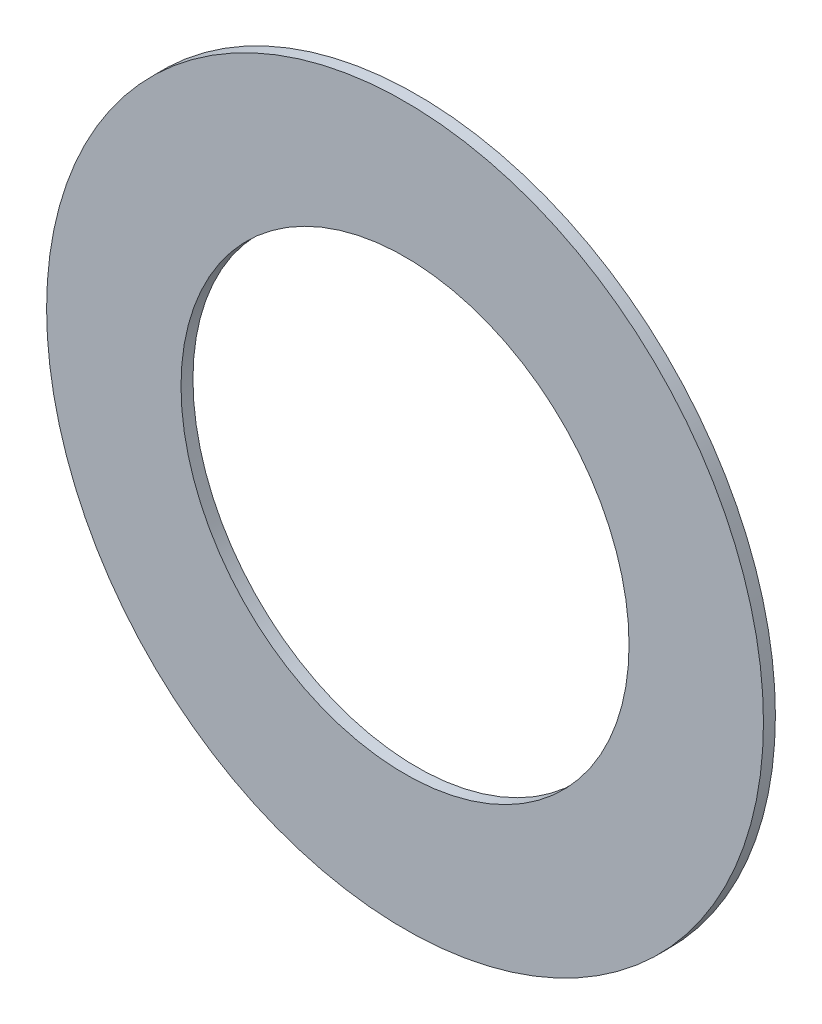
ISO-10303-21;
HEADER;
FILE_DESCRIPTION(('STEP AP214'),'2;1');
FILE_NAME('part.step','',(''),(''),'','','');
FILE_SCHEMA(('AUTOMOTIVE_DESIGN { 1 0 10303 214 1 1 1 1 }'));
ENDSEC;
DATA;
#1=APPLICATION_CONTEXT('core data for automotive mechanical design processes');
#2=APPLICATION_PROTOCOL_DEFINITION('international standard','automotive_design',2000,#1);
#3=PRODUCT_CONTEXT('',#1,'mechanical');
#4=PRODUCT('Part','Part','',(#3));
#5=PRODUCT_RELATED_PRODUCT_CATEGORY('part','',(#4));
#6=PRODUCT_DEFINITION_FORMATION('','',#4);
#7=PRODUCT_DEFINITION_CONTEXT('part definition',#1,'design');
#8=PRODUCT_DEFINITION('design','',#6,#7);
#9=PRODUCT_DEFINITION_SHAPE('','',#8);
#10=(LENGTH_UNIT() NAMED_UNIT(*) SI_UNIT(.MILLI.,.METRE.));
#11=(NAMED_UNIT(*) PLANE_ANGLE_UNIT() SI_UNIT($,.RADIAN.));
#12=(NAMED_UNIT(*) SI_UNIT($,.STERADIAN.) SOLID_ANGLE_UNIT());
#13=UNCERTAINTY_MEASURE_WITH_UNIT(LENGTH_MEASURE(1.E-05),#10,'distance_accuracy_value','');
#14=(GEOMETRIC_REPRESENTATION_CONTEXT(3) GLOBAL_UNCERTAINTY_ASSIGNED_CONTEXT((#13)) GLOBAL_UNIT_ASSIGNED_CONTEXT((#10,
#11,#12)) REPRESENTATION_CONTEXT('',''));
#15=CARTESIAN_POINT('',(0.,0.,0.));
#16=DIRECTION('',(0.,0.,1.));
#17=DIRECTION('',(1.,0.,0.));
#18=AXIS2_PLACEMENT_3D('',#15,#16,#17);
#19=CARTESIAN_POINT('',(0.,0.,0.508));
#20=DIRECTION('',(0.,0.,-1.));
#21=DIRECTION('',(-1.,0.,0.));
#22=AXIS2_PLACEMENT_3D('',#19,#20,#21);
#23=CYLINDRICAL_SURFACE('',#22,15.24);
#24=CARTESIAN_POINT('',(0.,0.,0.508));
#25=DIRECTION('',(0.,0.,1.));
#26=DIRECTION('',(1.,0.,0.));
#27=AXIS2_PLACEMENT_3D('',#24,#25,#26);
#28=CIRCLE('',#27,15.24);
#29=CARTESIAN_POINT('',(15.24,0.,0.508));
#30=VERTEX_POINT('',#29);
#31=EDGE_CURVE('E10',#30,#30,#28,.T.);
#32=ORIENTED_EDGE('',*,*,#31,.F.);
#33=EDGE_LOOP('',(#32));
#34=FACE_BOUND('',#33,.T.);
#35=CARTESIAN_POINT('',(0.,0.,0.));
#36=DIRECTION('',(0.,0.,1.));
#37=DIRECTION('',(1.,0.,0.));
#38=AXIS2_PLACEMENT_3D('',#35,#36,#37);
#39=CIRCLE('',#38,15.24);
#40=CARTESIAN_POINT('',(15.24,0.,0.));
#41=VERTEX_POINT('',#40);
#42=EDGE_CURVE('E36',#41,#41,#39,.T.);
#43=ORIENTED_EDGE('',*,*,#42,.T.);
#44=EDGE_LOOP('',(#43));
#45=FACE_BOUND('',#44,.T.);
#46=ADVANCED_FACE('F33',(#34,#45),#23,.T.);
#47=CARTESIAN_POINT('',(0.,0.,0.508));
#48=DIRECTION('',(0.,0.,1.));
#49=DIRECTION('',(1.,0.,0.));
#50=AXIS2_PLACEMENT_3D('',#47,#48,#49);
#51=PLANE('',#50);
#52=CARTESIAN_POINT('',(0.,0.,0.508));
#53=DIRECTION('',(0.,0.,1.));
#54=DIRECTION('',(1.,0.,0.));
#55=AXIS2_PLACEMENT_3D('',#52,#53,#54);
#56=CIRCLE('',#55,9.525);
#57=CARTESIAN_POINT('',(9.525,0.,0.508));
#58=VERTEX_POINT('',#57);
#59=EDGE_CURVE('E45',#58,#58,#56,.T.);
#60=ORIENTED_EDGE('',*,*,#59,.F.);
#61=EDGE_LOOP('',(#60));
#62=FACE_BOUND('',#61,.T.);
#63=ORIENTED_EDGE('',*,*,#31,.T.);
#64=EDGE_LOOP('',(#63));
#65=FACE_BOUND('',#64,.T.);
#66=ADVANCED_FACE('F60',(#62,#65),#51,.T.);
#67=CARTESIAN_POINT('',(0.,0.,0.));
#68=DIRECTION('',(0.,0.,1.));
#69=DIRECTION('',(1.,0.,0.));
#70=AXIS2_PLACEMENT_3D('',#67,#68,#69);
#71=PLANE('',#70);
#72=CARTESIAN_POINT('',(0.,0.,0.));
#73=DIRECTION('',(0.,0.,1.));
#74=DIRECTION('',(1.,0.,0.));
#75=AXIS2_PLACEMENT_3D('',#72,#73,#74);
#76=CIRCLE('',#75,9.525);
#77=CARTESIAN_POINT('',(9.525,0.,0.));
#78=VERTEX_POINT('',#77);
#79=EDGE_CURVE('E43',#78,#78,#76,.T.);
#80=ORIENTED_EDGE('',*,*,#79,.T.);
#81=EDGE_LOOP('',(#80));
#82=FACE_BOUND('',#81,.T.);
#83=ORIENTED_EDGE('',*,*,#42,.F.);
#84=EDGE_LOOP('',(#83));
#85=FACE_BOUND('',#84,.T.);
#86=ADVANCED_FACE('F51',(#82,#85),#71,.F.);
#87=CARTESIAN_POINT('',(0.,0.,0.));
#88=DIRECTION('',(0.,0.,1.));
#89=DIRECTION('',(1.,0.,0.));
#90=AXIS2_PLACEMENT_3D('',#87,#88,#89);
#91=CYLINDRICAL_SURFACE('',#90,9.525);
#92=ORIENTED_EDGE('',*,*,#79,.F.);
#93=EDGE_LOOP('',(#92));
#94=FACE_BOUND('',#93,.T.);
#95=ORIENTED_EDGE('',*,*,#59,.T.);
#96=EDGE_LOOP('',(#95));
#97=FACE_BOUND('',#96,.T.);
#98=ADVANCED_FACE('F54',(#94,#97),#91,.F.);
#99=CLOSED_SHELL('',(#46,#66,#86,#98));
#100=MANIFOLD_SOLID_BREP('B2',#99);
#101=ADVANCED_BREP_SHAPE_REPRESENTATION('',(#18,#100),#14);
#102=SHAPE_DEFINITION_REPRESENTATION(#9,#101);
ENDSEC;
END-ISO-10303-21;
